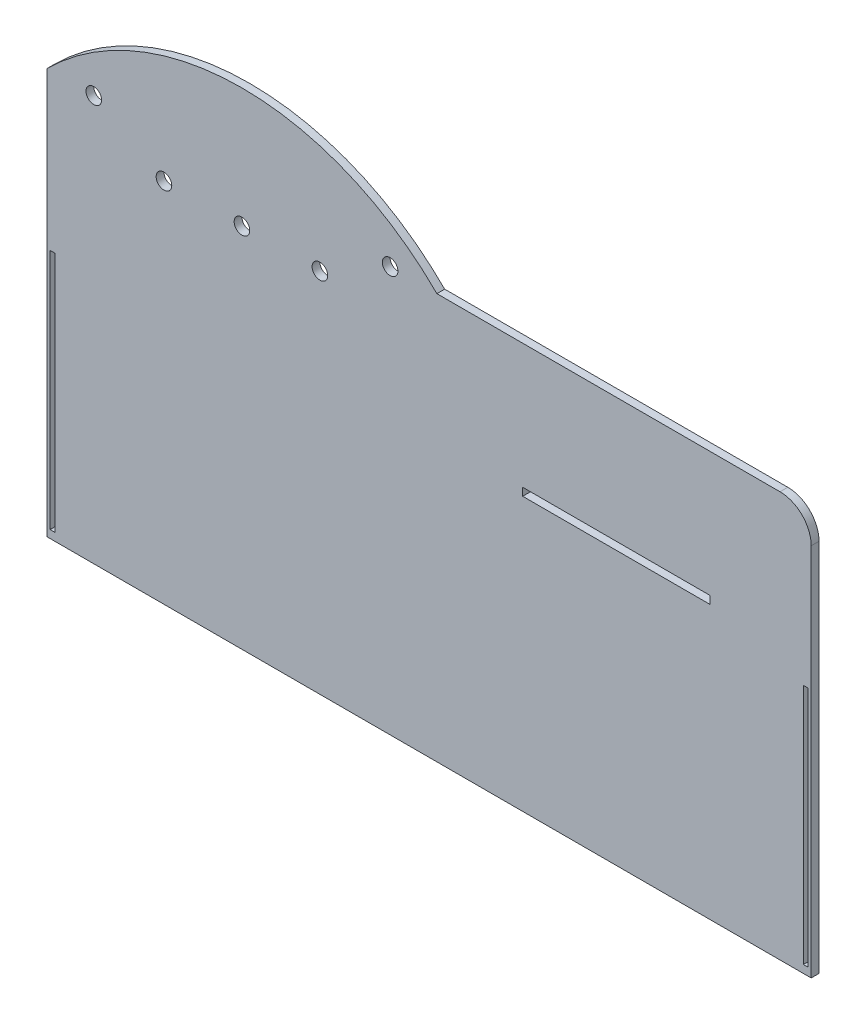
ISO-10303-21;
HEADER;
FILE_DESCRIPTION(('STEP AP214'),'2;1');
FILE_NAME('part.step','',(''),(''),'','','');
FILE_SCHEMA(('AUTOMOTIVE_DESIGN { 1 0 10303 214 1 1 1 1 }'));
ENDSEC;
DATA;
#1=APPLICATION_CONTEXT('core data for automotive mechanical design processes');
#2=APPLICATION_PROTOCOL_DEFINITION('international standard','automotive_design',2000,#1);
#3=PRODUCT_CONTEXT('',#1,'mechanical');
#4=PRODUCT('Part','Part','',(#3));
#5=PRODUCT_RELATED_PRODUCT_CATEGORY('part','',(#4));
#6=PRODUCT_DEFINITION_FORMATION('','',#4);
#7=PRODUCT_DEFINITION_CONTEXT('part definition',#1,'design');
#8=PRODUCT_DEFINITION('design','',#6,#7);
#9=PRODUCT_DEFINITION_SHAPE('','',#8);
#10=(LENGTH_UNIT() NAMED_UNIT(*) SI_UNIT(.MILLI.,.METRE.));
#11=(NAMED_UNIT(*) PLANE_ANGLE_UNIT() SI_UNIT($,.RADIAN.));
#12=(NAMED_UNIT(*) SI_UNIT($,.STERADIAN.) SOLID_ANGLE_UNIT());
#13=UNCERTAINTY_MEASURE_WITH_UNIT(LENGTH_MEASURE(1.E-05),#10,'distance_accuracy_value','');
#14=(GEOMETRIC_REPRESENTATION_CONTEXT(3) GLOBAL_UNCERTAINTY_ASSIGNED_CONTEXT((#13)) GLOBAL_UNIT_ASSIGNED_CONTEXT((#10,
#11,#12)) REPRESENTATION_CONTEXT('',''));
#15=CARTESIAN_POINT('',(0.,0.,0.));
#16=DIRECTION('',(0.,0.,1.));
#17=DIRECTION('',(1.,0.,0.));
#18=AXIS2_PLACEMENT_3D('',#15,#16,#17);
#19=CARTESIAN_POINT('',(311.15,165.1,6.35));
#20=DIRECTION('',(-1.,0.,0.));
#21=DIRECTION('',(0.,0.,1.));
#22=AXIS2_PLACEMENT_3D('',#19,#20,#21);
#23=PLANE('',#22);
#24=DIRECTION('',(0.,1.,0.));
#25=VECTOR('',#24,1.);
#26=CARTESIAN_POINT('',(311.15,165.1,0.));
#27=LINE('',#26,#25);
#28=CARTESIAN_POINT('',(311.15,-165.1,0.));
#29=VERTEX_POINT('',#28);
#30=CARTESIAN_POINT('',(311.15,139.7,0.));
#31=VERTEX_POINT('',#30);
#32=EDGE_CURVE('E281',#29,#31,#27,.T.);
#33=ORIENTED_EDGE('',*,*,#32,.T.);
#34=DIRECTION('',(0.,0.,-1.));
#35=VECTOR('',#34,1.);
#36=CARTESIAN_POINT('',(311.15,139.7,6.35));
#37=LINE('',#36,#35);
#38=CARTESIAN_POINT('',(311.15,139.7,6.35));
#39=VERTEX_POINT('',#38);
#40=EDGE_CURVE('E40',#31,#39,#37,.F.);
#41=ORIENTED_EDGE('',*,*,#40,.T.);
#42=DIRECTION('',(0.,1.,0.));
#43=VECTOR('',#42,1.);
#44=CARTESIAN_POINT('',(311.15,165.1,6.35));
#45=LINE('',#44,#43);
#46=CARTESIAN_POINT('',(311.15,-165.1,6.35));
#47=VERTEX_POINT('',#46);
#48=EDGE_CURVE('E288',#47,#39,#45,.T.);
#49=ORIENTED_EDGE('',*,*,#48,.F.);
#50=DIRECTION('',(0.,0.,-1.));
#51=VECTOR('',#50,1.);
#52=CARTESIAN_POINT('',(311.15,-165.1,6.35));
#53=LINE('',#52,#51);
#54=EDGE_CURVE('E300',#47,#29,#53,.T.);
#55=ORIENTED_EDGE('',*,*,#54,.T.);
#56=EDGE_LOOP('',(#33,#41,#49,#55));
#57=FACE_BOUND('',#56,.T.);
#58=ADVANCED_FACE('F32',(#57),#23,.F.);
#59=CARTESIAN_POINT('',(6.34999999999991,165.1,6.35));
#60=DIRECTION('',(0.,-1.,0.));
#61=DIRECTION('',(0.,0.,-1.));
#62=AXIS2_PLACEMENT_3D('',#59,#60,#61);
#63=PLANE('',#62);
#64=DIRECTION('',(-1.,0.,0.));
#65=VECTOR('',#64,1.);
#66=CARTESIAN_POINT('',(6.34999999999991,165.1,6.35));
#67=LINE('',#66,#65);
#68=CARTESIAN_POINT('',(285.75,165.1,6.35));
#69=VERTEX_POINT('',#68);
#70=CARTESIAN_POINT('',(6.34999999999991,165.1,6.35));
#71=VERTEX_POINT('',#70);
#72=EDGE_CURVE('E291',#69,#71,#67,.T.);
#73=ORIENTED_EDGE('',*,*,#72,.F.);
#74=DIRECTION('',(0.,0.,-1.));
#75=VECTOR('',#74,1.);
#76=CARTESIAN_POINT('',(285.75,165.1,6.35));
#77=LINE('',#76,#75);
#78=CARTESIAN_POINT('',(285.75,165.1,0.));
#79=VERTEX_POINT('',#78);
#80=EDGE_CURVE('E321',#69,#79,#77,.T.);
#81=ORIENTED_EDGE('',*,*,#80,.T.);
#82=DIRECTION('',(-1.,0.,0.));
#83=VECTOR('',#82,1.);
#84=CARTESIAN_POINT('',(6.34999999999991,165.1,0.));
#85=LINE('',#84,#83);
#86=CARTESIAN_POINT('',(6.34999999999991,165.1,0.));
#87=VERTEX_POINT('',#86);
#88=EDGE_CURVE('E303',#79,#87,#85,.T.);
#89=ORIENTED_EDGE('',*,*,#88,.T.);
#90=DIRECTION('',(0.,0.,-1.));
#91=VECTOR('',#90,1.);
#92=CARTESIAN_POINT('',(6.34999999999991,165.1,6.35));
#93=LINE('',#92,#91);
#94=EDGE_CURVE('E318',#71,#87,#93,.T.);
#95=ORIENTED_EDGE('',*,*,#94,.F.);
#96=EDGE_LOOP('',(#73,#81,#89,#95));
#97=FACE_BOUND('',#96,.T.);
#98=ADVANCED_FACE('F339',(#97),#63,.F.);
#99=CARTESIAN_POINT('',(-152.4,6.34999999999988,6.35));
#100=DIRECTION('',(0.,0.,-1.));
#101=DIRECTION('',(-1.,0.,0.));
#102=AXIS2_PLACEMENT_3D('',#99,#100,#101);
#103=CYLINDRICAL_SURFACE('',#102,224.506403026729);
#104=CARTESIAN_POINT('',(-152.4,6.34999999999988,0.));
#105=DIRECTION('',(0.,0.,1.));
#106=DIRECTION('',(-1.,0.,0.));
#107=AXIS2_PLACEMENT_3D('',#104,#105,#106);
#108=CIRCLE('',#107,224.506403026729);
#109=CARTESIAN_POINT('',(-311.15,165.1,0.));
#110=VERTEX_POINT('',#109);
#111=EDGE_CURVE('E305',#87,#110,#108,.T.);
#112=ORIENTED_EDGE('',*,*,#111,.T.);
#113=DIRECTION('',(0.,0.,-1.));
#114=VECTOR('',#113,1.);
#115=CARTESIAN_POINT('',(-311.15,165.1,6.35));
#116=LINE('',#115,#114);
#117=CARTESIAN_POINT('',(-311.15,165.1,6.35));
#118=VERTEX_POINT('',#117);
#119=EDGE_CURVE('E315',#118,#110,#116,.T.);
#120=ORIENTED_EDGE('',*,*,#119,.F.);
#121=CARTESIAN_POINT('',(-152.4,6.34999999999988,6.35));
#122=DIRECTION('',(0.,0.,1.));
#123=DIRECTION('',(-1.,0.,0.));
#124=AXIS2_PLACEMENT_3D('',#121,#122,#123);
#125=CIRCLE('',#124,224.506403026729);
#126=EDGE_CURVE('E294',#71,#118,#125,.T.);
#127=ORIENTED_EDGE('',*,*,#126,.F.);
#128=ORIENTED_EDGE('',*,*,#94,.T.);
#129=EDGE_LOOP('',(#112,#120,#127,#128));
#130=FACE_BOUND('',#129,.T.);
#131=ADVANCED_FACE('F347',(#130),#103,.T.);
#132=CARTESIAN_POINT('',(-311.15,165.1,6.35));
#133=DIRECTION('',(1.,0.,0.));
#134=DIRECTION('',(0.,1.,0.));
#135=AXIS2_PLACEMENT_3D('',#132,#133,#134);
#136=PLANE('',#135);
#137=DIRECTION('',(0.,-1.,0.));
#138=VECTOR('',#137,1.);
#139=CARTESIAN_POINT('',(-311.15,165.1,0.));
#140=LINE('',#139,#138);
#141=CARTESIAN_POINT('',(-311.15,-165.1,0.));
#142=VERTEX_POINT('',#141);
#143=EDGE_CURVE('E307',#110,#142,#140,.T.);
#144=ORIENTED_EDGE('',*,*,#143,.T.);
#145=DIRECTION('',(0.,0.,-1.));
#146=VECTOR('',#145,1.);
#147=CARTESIAN_POINT('',(-311.15,-165.1,6.35));
#148=LINE('',#147,#146);
#149=CARTESIAN_POINT('',(-311.15,-165.1,6.35));
#150=VERTEX_POINT('',#149);
#151=EDGE_CURVE('E312',#150,#142,#148,.T.);
#152=ORIENTED_EDGE('',*,*,#151,.F.);
#153=DIRECTION('',(0.,-1.,0.));
#154=VECTOR('',#153,1.);
#155=CARTESIAN_POINT('',(-311.15,165.1,6.35));
#156=LINE('',#155,#154);
#157=EDGE_CURVE('E296',#118,#150,#156,.T.);
#158=ORIENTED_EDGE('',*,*,#157,.F.);
#159=ORIENTED_EDGE('',*,*,#119,.T.);
#160=EDGE_LOOP('',(#144,#152,#158,#159));
#161=FACE_BOUND('',#160,.T.);
#162=ADVANCED_FACE('F351',(#161),#136,.F.);
#163=CARTESIAN_POINT('',(-311.15,-165.1,6.35));
#164=DIRECTION('',(0.,1.,0.));
#165=DIRECTION('',(0.,0.,1.));
#166=AXIS2_PLACEMENT_3D('',#163,#164,#165);
#167=PLANE('',#166);
#168=DIRECTION('',(1.,0.,0.));
#169=VECTOR('',#168,1.);
#170=CARTESIAN_POINT('',(-311.15,-165.1,0.));
#171=LINE('',#170,#169);
#172=EDGE_CURVE('E292',#142,#29,#171,.T.);
#173=ORIENTED_EDGE('',*,*,#172,.T.);
#174=ORIENTED_EDGE('',*,*,#54,.F.);
#175=DIRECTION('',(1.,0.,0.));
#176=VECTOR('',#175,1.);
#177=CARTESIAN_POINT('',(-311.15,-165.1,6.35));
#178=LINE('',#177,#176);
#179=EDGE_CURVE('E298',#150,#47,#178,.T.);
#180=ORIENTED_EDGE('',*,*,#179,.F.);
#181=ORIENTED_EDGE('',*,*,#151,.T.);
#182=EDGE_LOOP('',(#173,#174,#180,#181));
#183=FACE_BOUND('',#182,.T.);
#184=ADVANCED_FACE('F354',(#183),#167,.F.);
#185=CARTESIAN_POINT('',(-152.4,6.34999999999988,6.35));
#186=DIRECTION('',(0.,0.,-1.));
#187=DIRECTION('',(-1.,0.,0.));
#188=AXIS2_PLACEMENT_3D('',#185,#186,#187);
#189=PLANE('',#188);
#190=DIRECTION('',(1.,0.,0.));
#191=VECTOR('',#190,1.);
#192=CARTESIAN_POINT('',(-308.61,-158.75,6.35));
#193=LINE('',#192,#191);
#194=CARTESIAN_POINT('',(-308.61,-158.75,6.35));
#195=VERTEX_POINT('',#194);
#196=CARTESIAN_POINT('',(-304.8,-158.75,6.35));
#197=VERTEX_POINT('',#196);
#198=EDGE_CURVE('E186',#195,#197,#193,.T.);
#199=ORIENTED_EDGE('',*,*,#198,.F.);
#200=DIRECTION('',(0.,-1.,0.));
#201=VECTOR('',#200,1.);
#202=CARTESIAN_POINT('',(-308.61,-158.75,6.35));
#203=LINE('',#202,#201);
#204=CARTESIAN_POINT('',(-308.61,38.1,6.35));
#205=VERTEX_POINT('',#204);
#206=EDGE_CURVE('E47',#205,#195,#203,.T.);
#207=ORIENTED_EDGE('',*,*,#206,.F.);
#208=DIRECTION('',(-1.,0.,0.));
#209=VECTOR('',#208,1.);
#210=CARTESIAN_POINT('',(-308.61,38.1,6.35));
#211=LINE('',#210,#209);
#212=CARTESIAN_POINT('',(-304.8,38.1,6.35));
#213=VERTEX_POINT('',#212);
#214=EDGE_CURVE('E177',#213,#205,#211,.T.);
#215=ORIENTED_EDGE('',*,*,#214,.F.);
#216=DIRECTION('',(0.,1.,0.));
#217=VECTOR('',#216,1.);
#218=CARTESIAN_POINT('',(-304.8,-158.75,6.35));
#219=LINE('',#218,#217);
#220=EDGE_CURVE('E180',#197,#213,#219,.T.);
#221=ORIENTED_EDGE('',*,*,#220,.F.);
#222=EDGE_LOOP('',(#199,#207,#215,#221));
#223=FACE_BOUND('',#222,.T.);
#224=DIRECTION('',(-1.,0.,0.));
#225=VECTOR('',#224,1.);
#226=CARTESIAN_POINT('',(308.61,38.1,6.35));
#227=LINE('',#226,#225);
#228=CARTESIAN_POINT('',(308.61,38.1,6.35));
#229=VERTEX_POINT('',#228);
#230=CARTESIAN_POINT('',(304.8,38.1,6.35));
#231=VERTEX_POINT('',#230);
#232=EDGE_CURVE('E212',#229,#231,#227,.T.);
#233=ORIENTED_EDGE('',*,*,#232,.F.);
#234=DIRECTION('',(0.,1.,0.));
#235=VECTOR('',#234,1.);
#236=CARTESIAN_POINT('',(308.61,-158.75,6.35));
#237=LINE('',#236,#235);
#238=CARTESIAN_POINT('',(308.61,-158.75,6.35));
#239=VERTEX_POINT('',#238);
#240=EDGE_CURVE('E55',#239,#229,#237,.T.);
#241=ORIENTED_EDGE('',*,*,#240,.F.);
#242=DIRECTION('',(1.,0.,0.));
#243=VECTOR('',#242,1.);
#244=CARTESIAN_POINT('',(308.61,-158.75,6.35));
#245=LINE('',#244,#243);
#246=CARTESIAN_POINT('',(304.8,-158.75,6.35));
#247=VERTEX_POINT('',#246);
#248=EDGE_CURVE('E201',#247,#239,#245,.T.);
#249=ORIENTED_EDGE('',*,*,#248,.F.);
#250=DIRECTION('',(0.,-1.,0.));
#251=VECTOR('',#250,1.);
#252=CARTESIAN_POINT('',(304.8,-158.75,6.35));
#253=LINE('',#252,#251);
#254=EDGE_CURVE('E215',#231,#247,#253,.T.);
#255=ORIENTED_EDGE('',*,*,#254,.F.);
#256=EDGE_LOOP('',(#233,#241,#249,#255));
#257=FACE_BOUND('',#256,.T.);
#258=CARTESIAN_POINT('',(-273.05,165.1,6.35));
#259=DIRECTION('',(0.,0.,1.));
#260=DIRECTION('',(1.,0.,0.));
#261=AXIS2_PLACEMENT_3D('',#258,#259,#260);
#262=CIRCLE('',#261,6.34999999999999);
#263=CARTESIAN_POINT('',(-266.7,165.1,6.35));
#264=VERTEX_POINT('',#263);
#265=EDGE_CURVE('E230',#264,#264,#262,.T.);
#266=ORIENTED_EDGE('',*,*,#265,.F.);
#267=EDGE_LOOP('',(#266));
#268=FACE_BOUND('',#267,.T.);
#269=CARTESIAN_POINT('',(-31.7500000000001,165.1,6.35));
#270=DIRECTION('',(0.,0.,1.));
#271=DIRECTION('',(1.,0.,0.));
#272=AXIS2_PLACEMENT_3D('',#269,#270,#271);
#273=CIRCLE('',#272,6.35);
#274=CARTESIAN_POINT('',(-25.4000000000001,165.1,6.35));
#275=VERTEX_POINT('',#274);
#276=EDGE_CURVE('E193',#275,#275,#273,.T.);
#277=ORIENTED_EDGE('',*,*,#276,.F.);
#278=EDGE_LOOP('',(#277));
#279=FACE_BOUND('',#278,.T.);
#280=CARTESIAN_POINT('',(-88.9,133.35,6.35));
#281=DIRECTION('',(0.,0.,1.));
#282=DIRECTION('',(1.,0.,0.));
#283=AXIS2_PLACEMENT_3D('',#280,#281,#282);
#284=CIRCLE('',#283,6.35000000000001);
#285=CARTESIAN_POINT('',(-82.55,133.35,6.35));
#286=VERTEX_POINT('',#285);
#287=EDGE_CURVE('E229',#286,#286,#284,.T.);
#288=ORIENTED_EDGE('',*,*,#287,.F.);
#289=EDGE_LOOP('',(#288));
#290=FACE_BOUND('',#289,.T.);
#291=CARTESIAN_POINT('',(-215.9,133.35,6.35));
#292=DIRECTION('',(0.,0.,1.));
#293=DIRECTION('',(1.,0.,0.));
#294=AXIS2_PLACEMENT_3D('',#291,#292,#293);
#295=CIRCLE('',#294,6.34999999999999);
#296=CARTESIAN_POINT('',(-209.55,133.35,6.35));
#297=VERTEX_POINT('',#296);
#298=EDGE_CURVE('E242',#297,#297,#295,.T.);
#299=ORIENTED_EDGE('',*,*,#298,.F.);
#300=EDGE_LOOP('',(#299));
#301=FACE_BOUND('',#300,.T.);
#302=CARTESIAN_POINT('',(-152.4,133.35,6.35));
#303=DIRECTION('',(0.,0.,1.));
#304=DIRECTION('',(1.,0.,0.));
#305=AXIS2_PLACEMENT_3D('',#302,#303,#304);
#306=CIRCLE('',#305,6.34999999999999);
#307=CARTESIAN_POINT('',(-146.05,133.35,6.35));
#308=VERTEX_POINT('',#307);
#309=EDGE_CURVE('E241',#308,#308,#306,.T.);
#310=ORIENTED_EDGE('',*,*,#309,.F.);
#311=EDGE_LOOP('',(#310));
#312=FACE_BOUND('',#311,.T.);
#313=DIRECTION('',(1.,0.,0.));
#314=VECTOR('',#313,1.);
#315=CARTESIAN_POINT('',(76.2,57.15,6.35));
#316=LINE('',#315,#314);
#317=CARTESIAN_POINT('',(76.2,57.15,6.35));
#318=VERTEX_POINT('',#317);
#319=CARTESIAN_POINT('',(228.6,57.15,6.35));
#320=VERTEX_POINT('',#319);
#321=EDGE_CURVE('E271',#318,#320,#316,.T.);
#322=ORIENTED_EDGE('',*,*,#321,.F.);
#323=DIRECTION('',(0.,-1.,0.));
#324=VECTOR('',#323,1.);
#325=CARTESIAN_POINT('',(76.2,63.5,6.35));
#326=LINE('',#325,#324);
#327=CARTESIAN_POINT('',(76.2,63.5,6.35));
#328=VERTEX_POINT('',#327);
#329=EDGE_CURVE('E253',#328,#318,#326,.T.);
#330=ORIENTED_EDGE('',*,*,#329,.F.);
#331=DIRECTION('',(-1.,0.,0.));
#332=VECTOR('',#331,1.);
#333=CARTESIAN_POINT('',(76.2,63.5,6.35));
#334=LINE('',#333,#332);
#335=CARTESIAN_POINT('',(228.6,63.5,6.35));
#336=VERTEX_POINT('',#335);
#337=EDGE_CURVE('E260',#336,#328,#334,.T.);
#338=ORIENTED_EDGE('',*,*,#337,.F.);
#339=DIRECTION('',(0.,1.,0.));
#340=VECTOR('',#339,1.);
#341=CARTESIAN_POINT('',(228.6,63.5,6.35));
#342=LINE('',#341,#340);
#343=EDGE_CURVE('E274',#320,#336,#342,.T.);
#344=ORIENTED_EDGE('',*,*,#343,.F.);
#345=EDGE_LOOP('',(#322,#330,#338,#344));
#346=FACE_BOUND('',#345,.T.);
#347=ORIENTED_EDGE('',*,*,#48,.T.);
#348=CARTESIAN_POINT('',(285.75,139.7,6.35));
#349=DIRECTION('',(0.,0.,-1.));
#350=DIRECTION('',(-1.,0.,0.));
#351=AXIS2_PLACEMENT_3D('',#348,#349,#350);
#352=CIRCLE('',#351,25.4);
#353=EDGE_CURVE('E11',#39,#69,#352,.F.);
#354=ORIENTED_EDGE('',*,*,#353,.T.);
#355=ORIENTED_EDGE('',*,*,#72,.T.);
#356=ORIENTED_EDGE('',*,*,#126,.T.);
#357=ORIENTED_EDGE('',*,*,#157,.T.);
#358=ORIENTED_EDGE('',*,*,#179,.T.);
#359=EDGE_LOOP('',(#347,#354,#355,#356,#357,#358));
#360=FACE_BOUND('',#359,.T.);
#361=ADVANCED_FACE('F332',(#223,#257,#268,#279,#290,#301,#312,#346,#360),#189,.F.);
#362=CARTESIAN_POINT('',(-152.4,6.34999999999988,0.));
#363=DIRECTION('',(0.,0.,-1.));
#364=DIRECTION('',(-1.,0.,0.));
#365=AXIS2_PLACEMENT_3D('',#362,#363,#364);
#366=PLANE('',#365);
#367=DIRECTION('',(0.,-1.,0.));
#368=VECTOR('',#367,1.);
#369=CARTESIAN_POINT('',(-308.61,-158.75,0.));
#370=LINE('',#369,#368);
#371=CARTESIAN_POINT('',(-308.61,38.1,0.));
#372=VERTEX_POINT('',#371);
#373=CARTESIAN_POINT('',(-308.61,-158.75,0.));
#374=VERTEX_POINT('',#373);
#375=EDGE_CURVE('E158',#372,#374,#370,.T.);
#376=ORIENTED_EDGE('',*,*,#375,.T.);
#377=DIRECTION('',(1.,0.,0.));
#378=VECTOR('',#377,1.);
#379=CARTESIAN_POINT('',(-308.61,-158.75,0.));
#380=LINE('',#379,#378);
#381=CARTESIAN_POINT('',(-304.8,-158.75,0.));
#382=VERTEX_POINT('',#381);
#383=EDGE_CURVE('E168',#374,#382,#380,.T.);
#384=ORIENTED_EDGE('',*,*,#383,.T.);
#385=DIRECTION('',(0.,1.,0.));
#386=VECTOR('',#385,1.);
#387=CARTESIAN_POINT('',(-304.8,-158.75,0.));
#388=LINE('',#387,#386);
#389=CARTESIAN_POINT('',(-304.8,38.1,0.));
#390=VERTEX_POINT('',#389);
#391=EDGE_CURVE('E172',#382,#390,#388,.T.);
#392=ORIENTED_EDGE('',*,*,#391,.T.);
#393=DIRECTION('',(-1.,0.,0.));
#394=VECTOR('',#393,1.);
#395=CARTESIAN_POINT('',(-308.61,38.1,0.));
#396=LINE('',#395,#394);
#397=EDGE_CURVE('E164',#390,#372,#396,.T.);
#398=ORIENTED_EDGE('',*,*,#397,.T.);
#399=EDGE_LOOP('',(#376,#384,#392,#398));
#400=FACE_BOUND('',#399,.T.);
#401=DIRECTION('',(0.,1.,0.));
#402=VECTOR('',#401,1.);
#403=CARTESIAN_POINT('',(308.61,-158.75,0.));
#404=LINE('',#403,#402);
#405=CARTESIAN_POINT('',(308.61,-158.75,0.));
#406=VERTEX_POINT('',#405);
#407=CARTESIAN_POINT('',(308.61,38.1,0.));
#408=VERTEX_POINT('',#407);
#409=EDGE_CURVE('E197',#406,#408,#404,.T.);
#410=ORIENTED_EDGE('',*,*,#409,.T.);
#411=DIRECTION('',(-1.,0.,0.));
#412=VECTOR('',#411,1.);
#413=CARTESIAN_POINT('',(308.61,38.1,0.));
#414=LINE('',#413,#412);
#415=CARTESIAN_POINT('',(304.8,38.1,0.));
#416=VERTEX_POINT('',#415);
#417=EDGE_CURVE('E200',#408,#416,#414,.T.);
#418=ORIENTED_EDGE('',*,*,#417,.T.);
#419=DIRECTION('',(0.,-1.,0.));
#420=VECTOR('',#419,1.);
#421=CARTESIAN_POINT('',(304.8,-158.75,0.));
#422=LINE('',#421,#420);
#423=CARTESIAN_POINT('',(304.8,-158.75,0.));
#424=VERTEX_POINT('',#423);
#425=EDGE_CURVE('E204',#416,#424,#422,.T.);
#426=ORIENTED_EDGE('',*,*,#425,.T.);
#427=DIRECTION('',(1.,0.,0.));
#428=VECTOR('',#427,1.);
#429=CARTESIAN_POINT('',(308.61,-158.75,0.));
#430=LINE('',#429,#428);
#431=EDGE_CURVE('E207',#424,#406,#430,.T.);
#432=ORIENTED_EDGE('',*,*,#431,.T.);
#433=EDGE_LOOP('',(#410,#418,#426,#432));
#434=FACE_BOUND('',#433,.T.);
#435=CARTESIAN_POINT('',(-273.05,165.1,0.));
#436=DIRECTION('',(0.,0.,1.));
#437=DIRECTION('',(1.,0.,0.));
#438=AXIS2_PLACEMENT_3D('',#435,#436,#437);
#439=CIRCLE('',#438,6.34999999999999);
#440=CARTESIAN_POINT('',(-266.7,165.1,0.));
#441=VERTEX_POINT('',#440);
#442=EDGE_CURVE('E226',#441,#441,#439,.T.);
#443=ORIENTED_EDGE('',*,*,#442,.T.);
#444=EDGE_LOOP('',(#443));
#445=FACE_BOUND('',#444,.T.);
#446=CARTESIAN_POINT('',(-31.7500000000001,165.1,0.));
#447=DIRECTION('',(0.,0.,1.));
#448=DIRECTION('',(1.,0.,0.));
#449=AXIS2_PLACEMENT_3D('',#446,#447,#448);
#450=CIRCLE('',#449,6.35);
#451=CARTESIAN_POINT('',(-25.4000000000001,165.1,0.));
#452=VERTEX_POINT('',#451);
#453=EDGE_CURVE('E233',#452,#452,#450,.T.);
#454=ORIENTED_EDGE('',*,*,#453,.T.);
#455=EDGE_LOOP('',(#454));
#456=FACE_BOUND('',#455,.T.);
#457=CARTESIAN_POINT('',(-88.9,133.35,0.));
#458=DIRECTION('',(0.,0.,1.));
#459=DIRECTION('',(1.,0.,0.));
#460=AXIS2_PLACEMENT_3D('',#457,#458,#459);
#461=CIRCLE('',#460,6.35000000000001);
#462=CARTESIAN_POINT('',(-82.55,133.35,0.));
#463=VERTEX_POINT('',#462);
#464=EDGE_CURVE('E245',#463,#463,#461,.T.);
#465=ORIENTED_EDGE('',*,*,#464,.T.);
#466=EDGE_LOOP('',(#465));
#467=FACE_BOUND('',#466,.T.);
#468=CARTESIAN_POINT('',(-215.9,133.35,0.));
#469=DIRECTION('',(0.,0.,1.));
#470=DIRECTION('',(1.,0.,0.));
#471=AXIS2_PLACEMENT_3D('',#468,#469,#470);
#472=CIRCLE('',#471,6.34999999999999);
#473=CARTESIAN_POINT('',(-209.55,133.35,0.));
#474=VERTEX_POINT('',#473);
#475=EDGE_CURVE('E238',#474,#474,#472,.T.);
#476=ORIENTED_EDGE('',*,*,#475,.T.);
#477=EDGE_LOOP('',(#476));
#478=FACE_BOUND('',#477,.T.);
#479=CARTESIAN_POINT('',(-152.4,133.35,0.));
#480=DIRECTION('',(0.,0.,1.));
#481=DIRECTION('',(1.,0.,0.));
#482=AXIS2_PLACEMENT_3D('',#479,#480,#481);
#483=CIRCLE('',#482,6.34999999999999);
#484=CARTESIAN_POINT('',(-146.05,133.35,0.));
#485=VERTEX_POINT('',#484);
#486=EDGE_CURVE('E250',#485,#485,#483,.T.);
#487=ORIENTED_EDGE('',*,*,#486,.T.);
#488=EDGE_LOOP('',(#487));
#489=FACE_BOUND('',#488,.T.);
#490=DIRECTION('',(0.,-1.,0.));
#491=VECTOR('',#490,1.);
#492=CARTESIAN_POINT('',(76.2,63.5,0.));
#493=LINE('',#492,#491);
#494=CARTESIAN_POINT('',(76.2,63.5,0.));
#495=VERTEX_POINT('',#494);
#496=CARTESIAN_POINT('',(76.2,57.15,0.));
#497=VERTEX_POINT('',#496);
#498=EDGE_CURVE('E256',#495,#497,#493,.T.);
#499=ORIENTED_EDGE('',*,*,#498,.T.);
#500=DIRECTION('',(1.,0.,0.));
#501=VECTOR('',#500,1.);
#502=CARTESIAN_POINT('',(76.2,57.15,0.));
#503=LINE('',#502,#501);
#504=CARTESIAN_POINT('',(228.6,57.15,0.));
#505=VERTEX_POINT('',#504);
#506=EDGE_CURVE('E259',#497,#505,#503,.T.);
#507=ORIENTED_EDGE('',*,*,#506,.T.);
#508=DIRECTION('',(0.,1.,0.));
#509=VECTOR('',#508,1.);
#510=CARTESIAN_POINT('',(228.6,63.5,0.));
#511=LINE('',#510,#509);
#512=CARTESIAN_POINT('',(228.6,63.5,0.));
#513=VERTEX_POINT('',#512);
#514=EDGE_CURVE('E263',#505,#513,#511,.T.);
#515=ORIENTED_EDGE('',*,*,#514,.T.);
#516=DIRECTION('',(-1.,0.,0.));
#517=VECTOR('',#516,1.);
#518=CARTESIAN_POINT('',(76.2,63.5,0.));
#519=LINE('',#518,#517);
#520=EDGE_CURVE('E266',#513,#495,#519,.T.);
#521=ORIENTED_EDGE('',*,*,#520,.T.);
#522=EDGE_LOOP('',(#499,#507,#515,#521));
#523=FACE_BOUND('',#522,.T.);
#524=ORIENTED_EDGE('',*,*,#88,.F.);
#525=CARTESIAN_POINT('',(285.75,139.7,0.));
#526=DIRECTION('',(0.,0.,-1.));
#527=DIRECTION('',(-1.,0.,0.));
#528=AXIS2_PLACEMENT_3D('',#525,#526,#527);
#529=CIRCLE('',#528,25.4);
#530=EDGE_CURVE('E324',#79,#31,#529,.T.);
#531=ORIENTED_EDGE('',*,*,#530,.T.);
#532=ORIENTED_EDGE('',*,*,#32,.F.);
#533=ORIENTED_EDGE('',*,*,#172,.F.);
#534=ORIENTED_EDGE('',*,*,#143,.F.);
#535=ORIENTED_EDGE('',*,*,#111,.F.);
#536=EDGE_LOOP('',(#524,#531,#532,#533,#534,#535));
#537=FACE_BOUND('',#536,.T.);
#538=ADVANCED_FACE('F174',(#400,#434,#445,#456,#467,#478,#489,#523,#537),#366,.T.);
#539=CARTESIAN_POINT('',(76.2,63.5,0.));
#540=DIRECTION('',(-1.,0.,0.));
#541=DIRECTION('',(0.,0.,1.));
#542=AXIS2_PLACEMENT_3D('',#539,#540,#541);
#543=PLANE('',#542);
#544=ORIENTED_EDGE('',*,*,#329,.T.);
#545=DIRECTION('',(0.,0.,1.));
#546=VECTOR('',#545,1.);
#547=CARTESIAN_POINT('',(76.2,57.15,0.));
#548=LINE('',#547,#546);
#549=EDGE_CURVE('E269',#497,#318,#548,.T.);
#550=ORIENTED_EDGE('',*,*,#549,.F.);
#551=ORIENTED_EDGE('',*,*,#498,.F.);
#552=DIRECTION('',(0.,0.,1.));
#553=VECTOR('',#552,1.);
#554=CARTESIAN_POINT('',(76.2,63.5,0.));
#555=LINE('',#554,#553);
#556=EDGE_CURVE('E279',#495,#328,#555,.T.);
#557=ORIENTED_EDGE('',*,*,#556,.T.);
#558=EDGE_LOOP('',(#544,#550,#551,#557));
#559=FACE_BOUND('',#558,.T.);
#560=ADVANCED_FACE('F390',(#559),#543,.F.);
#561=CARTESIAN_POINT('',(76.2,63.5,0.));
#562=DIRECTION('',(0.,1.,0.));
#563=DIRECTION('',(-1.,0.,0.));
#564=AXIS2_PLACEMENT_3D('',#561,#562,#563);
#565=PLANE('',#564);
#566=ORIENTED_EDGE('',*,*,#337,.T.);
#567=ORIENTED_EDGE('',*,*,#556,.F.);
#568=ORIENTED_EDGE('',*,*,#520,.F.);
#569=DIRECTION('',(0.,0.,1.));
#570=VECTOR('',#569,1.);
#571=CARTESIAN_POINT('',(228.6,63.5,0.));
#572=LINE('',#571,#570);
#573=EDGE_CURVE('E282',#513,#336,#572,.T.);
#574=ORIENTED_EDGE('',*,*,#573,.T.);
#575=EDGE_LOOP('',(#566,#567,#568,#574));
#576=FACE_BOUND('',#575,.T.);
#577=ADVANCED_FACE('F395',(#576),#565,.F.);
#578=CARTESIAN_POINT('',(228.6,63.5,0.));
#579=DIRECTION('',(1.,0.,0.));
#580=DIRECTION('',(0.,0.,-1.));
#581=AXIS2_PLACEMENT_3D('',#578,#579,#580);
#582=PLANE('',#581);
#583=ORIENTED_EDGE('',*,*,#343,.T.);
#584=ORIENTED_EDGE('',*,*,#573,.F.);
#585=ORIENTED_EDGE('',*,*,#514,.F.);
#586=DIRECTION('',(0.,0.,1.));
#587=VECTOR('',#586,1.);
#588=CARTESIAN_POINT('',(228.6,57.15,0.));
#589=LINE('',#588,#587);
#590=EDGE_CURVE('E284',#505,#320,#589,.T.);
#591=ORIENTED_EDGE('',*,*,#590,.T.);
#592=EDGE_LOOP('',(#583,#584,#585,#591));
#593=FACE_BOUND('',#592,.T.);
#594=ADVANCED_FACE('F407',(#593),#582,.F.);
#595=CARTESIAN_POINT('',(76.2,57.15,0.));
#596=DIRECTION('',(0.,-1.,0.));
#597=DIRECTION('',(1.,0.,0.));
#598=AXIS2_PLACEMENT_3D('',#595,#596,#597);
#599=PLANE('',#598);
#600=ORIENTED_EDGE('',*,*,#321,.T.);
#601=ORIENTED_EDGE('',*,*,#590,.F.);
#602=ORIENTED_EDGE('',*,*,#506,.F.);
#603=ORIENTED_EDGE('',*,*,#549,.T.);
#604=EDGE_LOOP('',(#600,#601,#602,#603));
#605=FACE_BOUND('',#604,.T.);
#606=ADVANCED_FACE('F417',(#605),#599,.F.);
#607=CARTESIAN_POINT('',(-152.4,133.35,0.));
#608=DIRECTION('',(0.,0.,1.));
#609=DIRECTION('',(1.,0.,0.));
#610=AXIS2_PLACEMENT_3D('',#607,#608,#609);
#611=CYLINDRICAL_SURFACE('',#610,6.34999999999999);
#612=ORIENTED_EDGE('',*,*,#486,.F.);
#613=EDGE_LOOP('',(#612));
#614=FACE_BOUND('',#613,.T.);
#615=ORIENTED_EDGE('',*,*,#309,.T.);
#616=EDGE_LOOP('',(#615));
#617=FACE_BOUND('',#616,.T.);
#618=ADVANCED_FACE('F427',(#614,#617),#611,.F.);
#619=CARTESIAN_POINT('',(-215.9,133.35,0.));
#620=DIRECTION('',(0.,0.,1.));
#621=DIRECTION('',(1.,0.,0.));
#622=AXIS2_PLACEMENT_3D('',#619,#620,#621);
#623=CYLINDRICAL_SURFACE('',#622,6.34999999999999);
#624=ORIENTED_EDGE('',*,*,#475,.F.);
#625=EDGE_LOOP('',(#624));
#626=FACE_BOUND('',#625,.T.);
#627=ORIENTED_EDGE('',*,*,#298,.T.);
#628=EDGE_LOOP('',(#627));
#629=FACE_BOUND('',#628,.T.);
#630=ADVANCED_FACE('F437',(#626,#629),#623,.F.);
#631=CARTESIAN_POINT('',(-88.9,133.35,0.));
#632=DIRECTION('',(0.,0.,1.));
#633=DIRECTION('',(1.,0.,0.));
#634=AXIS2_PLACEMENT_3D('',#631,#632,#633);
#635=CYLINDRICAL_SURFACE('',#634,6.35000000000001);
#636=ORIENTED_EDGE('',*,*,#464,.F.);
#637=EDGE_LOOP('',(#636));
#638=FACE_BOUND('',#637,.T.);
#639=ORIENTED_EDGE('',*,*,#287,.T.);
#640=EDGE_LOOP('',(#639));
#641=FACE_BOUND('',#640,.T.);
#642=ADVANCED_FACE('F447',(#638,#641),#635,.F.);
#643=CARTESIAN_POINT('',(-31.7500000000001,165.1,0.));
#644=DIRECTION('',(0.,0.,1.));
#645=DIRECTION('',(1.,0.,0.));
#646=AXIS2_PLACEMENT_3D('',#643,#644,#645);
#647=CYLINDRICAL_SURFACE('',#646,6.35);
#648=ORIENTED_EDGE('',*,*,#453,.F.);
#649=EDGE_LOOP('',(#648));
#650=FACE_BOUND('',#649,.T.);
#651=ORIENTED_EDGE('',*,*,#276,.T.);
#652=EDGE_LOOP('',(#651));
#653=FACE_BOUND('',#652,.T.);
#654=ADVANCED_FACE('F457',(#650,#653),#647,.F.);
#655=CARTESIAN_POINT('',(-273.05,165.1,0.));
#656=DIRECTION('',(0.,0.,1.));
#657=DIRECTION('',(1.,0.,0.));
#658=AXIS2_PLACEMENT_3D('',#655,#656,#657);
#659=CYLINDRICAL_SURFACE('',#658,6.34999999999999);
#660=ORIENTED_EDGE('',*,*,#442,.F.);
#661=EDGE_LOOP('',(#660));
#662=FACE_BOUND('',#661,.T.);
#663=ORIENTED_EDGE('',*,*,#265,.T.);
#664=EDGE_LOOP('',(#663));
#665=FACE_BOUND('',#664,.T.);
#666=ADVANCED_FACE('F467',(#662,#665),#659,.F.);
#667=CARTESIAN_POINT('',(285.75,139.7,6.35));
#668=DIRECTION('',(0.,0.,-1.));
#669=DIRECTION('',(-1.,0.,0.));
#670=AXIS2_PLACEMENT_3D('',#667,#668,#669);
#671=CYLINDRICAL_SURFACE('',#670,25.4);
#672=ORIENTED_EDGE('',*,*,#353,.F.);
#673=ORIENTED_EDGE('',*,*,#40,.F.);
#674=ORIENTED_EDGE('',*,*,#530,.F.);
#675=ORIENTED_EDGE('',*,*,#80,.F.);
#676=EDGE_LOOP('',(#672,#673,#674,#675));
#677=FACE_BOUND('',#676,.T.);
#678=ADVANCED_FACE('F34',(#677),#671,.T.);
#679=CARTESIAN_POINT('',(308.61,-158.75,0.));
#680=DIRECTION('',(1.,0.,0.));
#681=DIRECTION('',(0.,0.,-1.));
#682=AXIS2_PLACEMENT_3D('',#679,#680,#681);
#683=PLANE('',#682);
#684=ORIENTED_EDGE('',*,*,#240,.T.);
#685=DIRECTION('',(0.,0.,1.));
#686=VECTOR('',#685,1.);
#687=CARTESIAN_POINT('',(308.61,38.1,0.));
#688=LINE('',#687,#686);
#689=EDGE_CURVE('E210',#408,#229,#688,.T.);
#690=ORIENTED_EDGE('',*,*,#689,.F.);
#691=ORIENTED_EDGE('',*,*,#409,.F.);
#692=DIRECTION('',(0.,0.,1.));
#693=VECTOR('',#692,1.);
#694=CARTESIAN_POINT('',(308.61,-158.75,0.));
#695=LINE('',#694,#693);
#696=EDGE_CURVE('E187',#406,#239,#695,.T.);
#697=ORIENTED_EDGE('',*,*,#696,.T.);
#698=EDGE_LOOP('',(#684,#690,#691,#697));
#699=FACE_BOUND('',#698,.T.);
#700=ADVANCED_FACE('F494',(#699),#683,.F.);
#701=CARTESIAN_POINT('',(308.61,-158.75,0.));
#702=DIRECTION('',(0.,-1.,0.));
#703=DIRECTION('',(0.,0.,-1.));
#704=AXIS2_PLACEMENT_3D('',#701,#702,#703);
#705=PLANE('',#704);
#706=ORIENTED_EDGE('',*,*,#248,.T.);
#707=ORIENTED_EDGE('',*,*,#696,.F.);
#708=ORIENTED_EDGE('',*,*,#431,.F.);
#709=DIRECTION('',(0.,0.,1.));
#710=VECTOR('',#709,1.);
#711=CARTESIAN_POINT('',(304.8,-158.75,0.));
#712=LINE('',#711,#710);
#713=EDGE_CURVE('E221',#424,#247,#712,.T.);
#714=ORIENTED_EDGE('',*,*,#713,.T.);
#715=EDGE_LOOP('',(#706,#707,#708,#714));
#716=FACE_BOUND('',#715,.T.);
#717=ADVANCED_FACE('F512',(#716),#705,.F.);
#718=CARTESIAN_POINT('',(304.8,-158.75,0.));
#719=DIRECTION('',(-1.,0.,0.));
#720=DIRECTION('',(0.,0.,1.));
#721=AXIS2_PLACEMENT_3D('',#718,#719,#720);
#722=PLANE('',#721);
#723=ORIENTED_EDGE('',*,*,#254,.T.);
#724=ORIENTED_EDGE('',*,*,#713,.F.);
#725=ORIENTED_EDGE('',*,*,#425,.F.);
#726=DIRECTION('',(0.,0.,1.));
#727=VECTOR('',#726,1.);
#728=CARTESIAN_POINT('',(304.8,38.1,0.));
#729=LINE('',#728,#727);
#730=EDGE_CURVE('E223',#416,#231,#729,.T.);
#731=ORIENTED_EDGE('',*,*,#730,.T.);
#732=EDGE_LOOP('',(#723,#724,#725,#731));
#733=FACE_BOUND('',#732,.T.);
#734=ADVANCED_FACE('F521',(#733),#722,.F.);
#735=CARTESIAN_POINT('',(308.61,38.1,0.));
#736=DIRECTION('',(0.,1.,0.));
#737=DIRECTION('',(0.,0.,1.));
#738=AXIS2_PLACEMENT_3D('',#735,#736,#737);
#739=PLANE('',#738);
#740=ORIENTED_EDGE('',*,*,#232,.T.);
#741=ORIENTED_EDGE('',*,*,#730,.F.);
#742=ORIENTED_EDGE('',*,*,#417,.F.);
#743=ORIENTED_EDGE('',*,*,#689,.T.);
#744=EDGE_LOOP('',(#740,#741,#742,#743));
#745=FACE_BOUND('',#744,.T.);
#746=ADVANCED_FACE('F531',(#745),#739,.F.);
#747=CARTESIAN_POINT('',(-308.61,-158.75,0.));
#748=DIRECTION('',(-1.,0.,0.));
#749=DIRECTION('',(0.,0.,1.));
#750=AXIS2_PLACEMENT_3D('',#747,#748,#749);
#751=PLANE('',#750);
#752=ORIENTED_EDGE('',*,*,#206,.T.);
#753=DIRECTION('',(0.,0.,1.));
#754=VECTOR('',#753,1.);
#755=CARTESIAN_POINT('',(-308.61,-158.75,0.));
#756=LINE('',#755,#754);
#757=EDGE_CURVE('E154',#374,#195,#756,.T.);
#758=ORIENTED_EDGE('',*,*,#757,.F.);
#759=ORIENTED_EDGE('',*,*,#375,.F.);
#760=DIRECTION('',(0.,0.,1.));
#761=VECTOR('',#760,1.);
#762=CARTESIAN_POINT('',(-308.61,38.1,0.));
#763=LINE('',#762,#761);
#764=EDGE_CURVE('E191',#372,#205,#763,.T.);
#765=ORIENTED_EDGE('',*,*,#764,.T.);
#766=EDGE_LOOP('',(#752,#758,#759,#765));
#767=FACE_BOUND('',#766,.T.);
#768=ADVANCED_FACE('F156',(#767),#751,.F.);
#769=CARTESIAN_POINT('',(-308.61,38.1,0.));
#770=DIRECTION('',(0.,1.,0.));
#771=DIRECTION('',(0.,0.,1.));
#772=AXIS2_PLACEMENT_3D('',#769,#770,#771);
#773=PLANE('',#772);
#774=ORIENTED_EDGE('',*,*,#214,.T.);
#775=ORIENTED_EDGE('',*,*,#764,.F.);
#776=ORIENTED_EDGE('',*,*,#397,.F.);
#777=DIRECTION('',(0.,0.,1.));
#778=VECTOR('',#777,1.);
#779=CARTESIAN_POINT('',(-304.8,38.1,0.));
#780=LINE('',#779,#778);
#781=EDGE_CURVE('E194',#390,#213,#780,.T.);
#782=ORIENTED_EDGE('',*,*,#781,.T.);
#783=EDGE_LOOP('',(#774,#775,#776,#782));
#784=FACE_BOUND('',#783,.T.);
#785=ADVANCED_FACE('F550',(#784),#773,.F.);
#786=CARTESIAN_POINT('',(-304.8,-158.75,0.));
#787=DIRECTION('',(1.,0.,0.));
#788=DIRECTION('',(0.,0.,-1.));
#789=AXIS2_PLACEMENT_3D('',#786,#787,#788);
#790=PLANE('',#789);
#791=ORIENTED_EDGE('',*,*,#220,.T.);
#792=ORIENTED_EDGE('',*,*,#781,.F.);
#793=ORIENTED_EDGE('',*,*,#391,.F.);
#794=DIRECTION('',(0.,0.,1.));
#795=VECTOR('',#794,1.);
#796=CARTESIAN_POINT('',(-304.8,-158.75,0.));
#797=LINE('',#796,#795);
#798=EDGE_CURVE('E163',#382,#197,#797,.T.);
#799=ORIENTED_EDGE('',*,*,#798,.T.);
#800=EDGE_LOOP('',(#791,#792,#793,#799));
#801=FACE_BOUND('',#800,.T.);
#802=ADVANCED_FACE('F559',(#801),#790,.F.);
#803=CARTESIAN_POINT('',(-308.61,-158.75,0.));
#804=DIRECTION('',(0.,-1.,0.));
#805=DIRECTION('',(0.,0.,-1.));
#806=AXIS2_PLACEMENT_3D('',#803,#804,#805);
#807=PLANE('',#806);
#808=ORIENTED_EDGE('',*,*,#198,.T.);
#809=ORIENTED_EDGE('',*,*,#798,.F.);
#810=ORIENTED_EDGE('',*,*,#383,.F.);
#811=ORIENTED_EDGE('',*,*,#757,.T.);
#812=EDGE_LOOP('',(#808,#809,#810,#811));
#813=FACE_BOUND('',#812,.T.);
#814=ADVANCED_FACE('F169',(#813),#807,.F.);
#815=CLOSED_SHELL('',(#58,#98,#131,#162,#184,#361,#538,#560,#577,#594,#606,#618,#630,#642,#654,
#666,#678,#700,#717,#734,#746,#768,#785,#802,#814));
#816=MANIFOLD_SOLID_BREP('B2',#815);
#817=ADVANCED_BREP_SHAPE_REPRESENTATION('',(#18,#816),#14);
#818=SHAPE_DEFINITION_REPRESENTATION(#9,#817);
ENDSEC;
END-ISO-10303-21;
